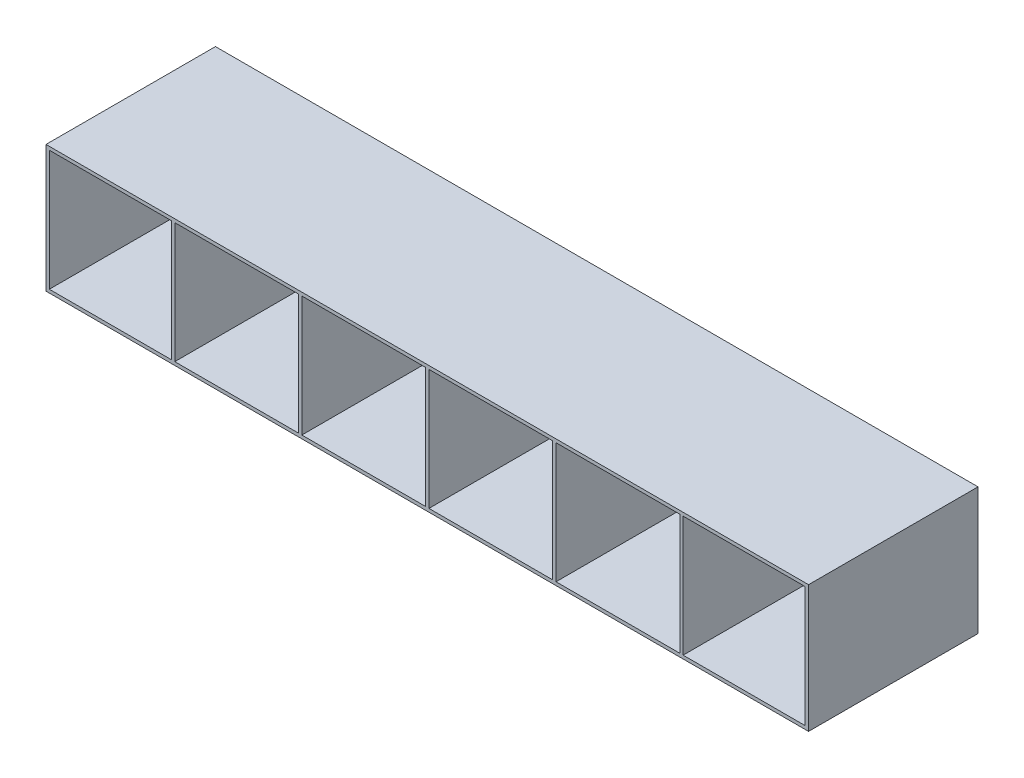
ISO-10303-21;
HEADER;
FILE_DESCRIPTION(('STEP AP214'),'2;1');
FILE_NAME('part.step','',(''),(''),'','','');
FILE_SCHEMA(('AUTOMOTIVE_DESIGN { 1 0 10303 214 1 1 1 1 }'));
ENDSEC;
DATA;
#1=APPLICATION_CONTEXT('core data for automotive mechanical design processes');
#2=APPLICATION_PROTOCOL_DEFINITION('international standard','automotive_design',2000,#1);
#3=PRODUCT_CONTEXT('',#1,'mechanical');
#4=PRODUCT('Part','Part','',(#3));
#5=PRODUCT_RELATED_PRODUCT_CATEGORY('part','',(#4));
#6=PRODUCT_DEFINITION_FORMATION('','',#4);
#7=PRODUCT_DEFINITION_CONTEXT('part definition',#1,'design');
#8=PRODUCT_DEFINITION('design','',#6,#7);
#9=PRODUCT_DEFINITION_SHAPE('','',#8);
#10=(LENGTH_UNIT() NAMED_UNIT(*) SI_UNIT(.MILLI.,.METRE.));
#11=(NAMED_UNIT(*) PLANE_ANGLE_UNIT() SI_UNIT($,.RADIAN.));
#12=(NAMED_UNIT(*) SI_UNIT($,.STERADIAN.) SOLID_ANGLE_UNIT());
#13=UNCERTAINTY_MEASURE_WITH_UNIT(LENGTH_MEASURE(1.E-05),#10,'distance_accuracy_value','');
#14=(GEOMETRIC_REPRESENTATION_CONTEXT(3) GLOBAL_UNCERTAINTY_ASSIGNED_CONTEXT((#13)) GLOBAL_UNIT_ASSIGNED_CONTEXT((#10,
#11,#12)) REPRESENTATION_CONTEXT('',''));
#15=CARTESIAN_POINT('',(0.,0.,0.));
#16=DIRECTION('',(0.,0.,1.));
#17=DIRECTION('',(1.,0.,0.));
#18=AXIS2_PLACEMENT_3D('',#15,#16,#17);
#19=CARTESIAN_POINT('',(-228.6,38.1,101.6));
#20=DIRECTION('',(1.,0.,0.));
#21=DIRECTION('',(0.,1.,0.));
#22=AXIS2_PLACEMENT_3D('',#19,#20,#21);
#23=PLANE('',#22);
#24=DIRECTION('',(0.,-1.,0.));
#25=VECTOR('',#24,1.);
#26=CARTESIAN_POINT('',(-228.6,38.1,0.));
#27=LINE('',#26,#25);
#28=CARTESIAN_POINT('',(-228.6,38.1,0.));
#29=VERTEX_POINT('',#28);
#30=CARTESIAN_POINT('',(-228.6,-38.1,0.));
#31=VERTEX_POINT('',#30);
#32=EDGE_CURVE('E411',#29,#31,#27,.T.);
#33=ORIENTED_EDGE('',*,*,#32,.T.);
#34=DIRECTION('',(0.,0.,-1.));
#35=VECTOR('',#34,1.);
#36=CARTESIAN_POINT('',(-228.6,-38.1,101.6));
#37=LINE('',#36,#35);
#38=CARTESIAN_POINT('',(-228.6,-38.1,101.6));
#39=VERTEX_POINT('',#38);
#40=EDGE_CURVE('E11',#39,#31,#37,.T.);
#41=ORIENTED_EDGE('',*,*,#40,.F.);
#42=DIRECTION('',(0.,-1.,0.));
#43=VECTOR('',#42,1.);
#44=CARTESIAN_POINT('',(-228.6,38.1,101.6));
#45=LINE('',#44,#43);
#46=CARTESIAN_POINT('',(-228.6,38.1,101.6));
#47=VERTEX_POINT('',#46);
#48=EDGE_CURVE('E412',#47,#39,#45,.T.);
#49=ORIENTED_EDGE('',*,*,#48,.F.);
#50=DIRECTION('',(0.,0.,-1.));
#51=VECTOR('',#50,1.);
#52=CARTESIAN_POINT('',(-228.6,38.1,101.6));
#53=LINE('',#52,#51);
#54=EDGE_CURVE('E424',#47,#29,#53,.T.);
#55=ORIENTED_EDGE('',*,*,#54,.T.);
#56=EDGE_LOOP('',(#33,#41,#49,#55));
#57=FACE_BOUND('',#56,.T.);
#58=ADVANCED_FACE('F35',(#57),#23,.F.);
#59=CARTESIAN_POINT('',(-228.6,-38.1,101.6));
#60=DIRECTION('',(0.,1.,0.));
#61=DIRECTION('',(0.,0.,1.));
#62=AXIS2_PLACEMENT_3D('',#59,#60,#61);
#63=PLANE('',#62);
#64=DIRECTION('',(1.,0.,0.));
#65=VECTOR('',#64,1.);
#66=CARTESIAN_POINT('',(-228.6,-38.1,0.));
#67=LINE('',#66,#65);
#68=CARTESIAN_POINT('',(228.6,-38.1,0.));
#69=VERTEX_POINT('',#68);
#70=EDGE_CURVE('E427',#31,#69,#67,.T.);
#71=ORIENTED_EDGE('',*,*,#70,.T.);
#72=DIRECTION('',(0.,0.,-1.));
#73=VECTOR('',#72,1.);
#74=CARTESIAN_POINT('',(228.6,-38.1,101.6));
#75=LINE('',#74,#73);
#76=CARTESIAN_POINT('',(228.6,-38.1,101.6));
#77=VERTEX_POINT('',#76);
#78=EDGE_CURVE('E42',#77,#69,#75,.T.);
#79=ORIENTED_EDGE('',*,*,#78,.F.);
#80=DIRECTION('',(1.,0.,0.));
#81=VECTOR('',#80,1.);
#82=CARTESIAN_POINT('',(-228.6,-38.1,101.6));
#83=LINE('',#82,#81);
#84=EDGE_CURVE('E415',#39,#77,#83,.T.);
#85=ORIENTED_EDGE('',*,*,#84,.F.);
#86=ORIENTED_EDGE('',*,*,#40,.T.);
#87=EDGE_LOOP('',(#71,#79,#85,#86));
#88=FACE_BOUND('',#87,.T.);
#89=ADVANCED_FACE('F443',(#88),#63,.F.);
#90=CARTESIAN_POINT('',(228.6,38.1,101.6));
#91=DIRECTION('',(1.,0.,0.));
#92=DIRECTION('',(0.,1.,0.));
#93=AXIS2_PLACEMENT_3D('',#90,#91,#92);
#94=PLANE('',#93);
#95=DIRECTION('',(0.,-1.,0.));
#96=VECTOR('',#95,1.);
#97=CARTESIAN_POINT('',(228.6,38.1,0.));
#98=LINE('',#97,#96);
#99=CARTESIAN_POINT('',(228.6,38.1,0.));
#100=VERTEX_POINT('',#99);
#101=EDGE_CURVE('E430',#100,#69,#98,.T.);
#102=ORIENTED_EDGE('',*,*,#101,.F.);
#103=DIRECTION('',(0.,0.,-1.));
#104=VECTOR('',#103,1.);
#105=CARTESIAN_POINT('',(228.6,38.1,101.6));
#106=LINE('',#105,#104);
#107=CARTESIAN_POINT('',(228.6,38.1,101.6));
#108=VERTEX_POINT('',#107);
#109=EDGE_CURVE('E436',#108,#100,#106,.T.);
#110=ORIENTED_EDGE('',*,*,#109,.F.);
#111=DIRECTION('',(0.,-1.,0.));
#112=VECTOR('',#111,1.);
#113=CARTESIAN_POINT('',(228.6,38.1,101.6));
#114=LINE('',#113,#112);
#115=EDGE_CURVE('E418',#108,#77,#114,.T.);
#116=ORIENTED_EDGE('',*,*,#115,.T.);
#117=ORIENTED_EDGE('',*,*,#78,.T.);
#118=EDGE_LOOP('',(#102,#110,#116,#117));
#119=FACE_BOUND('',#118,.T.);
#120=ADVANCED_FACE('F440',(#119),#94,.T.);
#121=CARTESIAN_POINT('',(-228.6,38.1,101.6));
#122=DIRECTION('',(0.,1.,0.));
#123=DIRECTION('',(0.,0.,1.));
#124=AXIS2_PLACEMENT_3D('',#121,#122,#123);
#125=PLANE('',#124);
#126=DIRECTION('',(1.,0.,0.));
#127=VECTOR('',#126,1.);
#128=CARTESIAN_POINT('',(-228.6,38.1,0.));
#129=LINE('',#128,#127);
#130=EDGE_CURVE('E416',#29,#100,#129,.T.);
#131=ORIENTED_EDGE('',*,*,#130,.F.);
#132=ORIENTED_EDGE('',*,*,#54,.F.);
#133=DIRECTION('',(1.,0.,0.));
#134=VECTOR('',#133,1.);
#135=CARTESIAN_POINT('',(-228.6,38.1,101.6));
#136=LINE('',#135,#134);
#137=EDGE_CURVE('E421',#47,#108,#136,.T.);
#138=ORIENTED_EDGE('',*,*,#137,.T.);
#139=ORIENTED_EDGE('',*,*,#109,.T.);
#140=EDGE_LOOP('',(#131,#132,#138,#139));
#141=FACE_BOUND('',#140,.T.);
#142=ADVANCED_FACE('F450',(#141),#125,.T.);
#143=CARTESIAN_POINT('',(0.,0.,101.6));
#144=DIRECTION('',(0.,0.,1.));
#145=DIRECTION('',(1.,0.,0.));
#146=AXIS2_PLACEMENT_3D('',#143,#144,#145);
#147=PLANE('',#146);
#148=DIRECTION('',(0.,-1.,0.));
#149=VECTOR('',#148,1.);
#150=CARTESIAN_POINT('',(151.4,0.,101.6));
#151=LINE('',#150,#149);
#152=CARTESIAN_POINT('',(151.4,36.1,101.6));
#153=VERTEX_POINT('',#152);
#154=CARTESIAN_POINT('',(151.4,-36.1,101.6));
#155=VERTEX_POINT('',#154);
#156=EDGE_CURVE('E232',#153,#155,#151,.T.);
#157=ORIENTED_EDGE('',*,*,#156,.T.);
#158=DIRECTION('',(1.,0.,0.));
#159=VECTOR('',#158,1.);
#160=CARTESIAN_POINT('',(0.,-36.1,101.6));
#161=LINE('',#160,#159);
#162=CARTESIAN_POINT('',(77.2,-36.1,101.6));
#163=VERTEX_POINT('',#162);
#164=EDGE_CURVE('E243',#163,#155,#161,.T.);
#165=ORIENTED_EDGE('',*,*,#164,.F.);
#166=DIRECTION('',(0.,-1.,0.));
#167=VECTOR('',#166,1.);
#168=CARTESIAN_POINT('',(77.2,0.,101.6));
#169=LINE('',#168,#167);
#170=CARTESIAN_POINT('',(77.2,36.1,101.6));
#171=VERTEX_POINT('',#170);
#172=EDGE_CURVE('E241',#171,#163,#169,.T.);
#173=ORIENTED_EDGE('',*,*,#172,.F.);
#174=DIRECTION('',(1.,0.,0.));
#175=VECTOR('',#174,1.);
#176=CARTESIAN_POINT('',(0.,36.1,101.6));
#177=LINE('',#176,#175);
#178=EDGE_CURVE('E224',#171,#153,#177,.T.);
#179=ORIENTED_EDGE('',*,*,#178,.T.);
#180=EDGE_LOOP('',(#157,#165,#173,#179));
#181=FACE_BOUND('',#180,.T.);
#182=DIRECTION('',(1.,0.,0.));
#183=VECTOR('',#182,1.);
#184=CARTESIAN_POINT('',(0.,36.1,101.6));
#185=LINE('',#184,#183);
#186=CARTESIAN_POINT('',(153.4,36.1,101.6));
#187=VERTEX_POINT('',#186);
#188=CARTESIAN_POINT('',(226.6,36.1,101.6));
#189=VERTEX_POINT('',#188);
#190=EDGE_CURVE('E257',#187,#189,#185,.T.);
#191=ORIENTED_EDGE('',*,*,#190,.T.);
#192=DIRECTION('',(0.,-1.,0.));
#193=VECTOR('',#192,1.);
#194=CARTESIAN_POINT('',(226.6,0.,101.6));
#195=LINE('',#194,#193);
#196=CARTESIAN_POINT('',(226.6,-36.1,101.6));
#197=VERTEX_POINT('',#196);
#198=EDGE_CURVE('E266',#189,#197,#195,.T.);
#199=ORIENTED_EDGE('',*,*,#198,.T.);
#200=DIRECTION('',(1.,0.,0.));
#201=VECTOR('',#200,1.);
#202=CARTESIAN_POINT('',(0.,-36.1,101.6));
#203=LINE('',#202,#201);
#204=CARTESIAN_POINT('',(153.4,-36.1,101.6));
#205=VERTEX_POINT('',#204);
#206=EDGE_CURVE('E263',#205,#197,#203,.T.);
#207=ORIENTED_EDGE('',*,*,#206,.F.);
#208=DIRECTION('',(0.,-1.,0.));
#209=VECTOR('',#208,1.);
#210=CARTESIAN_POINT('',(153.4,0.,101.6));
#211=LINE('',#210,#209);
#212=EDGE_CURVE('E260',#187,#205,#211,.T.);
#213=ORIENTED_EDGE('',*,*,#212,.F.);
#214=EDGE_LOOP('',(#191,#199,#207,#213));
#215=FACE_BOUND('',#214,.T.);
#216=DIRECTION('',(0.,-1.,0.));
#217=VECTOR('',#216,1.);
#218=CARTESIAN_POINT('',(75.2,0.,101.6));
#219=LINE('',#218,#217);
#220=CARTESIAN_POINT('',(75.2,36.1,101.6));
#221=VERTEX_POINT('',#220);
#222=CARTESIAN_POINT('',(75.2,-36.1,101.6));
#223=VERTEX_POINT('',#222);
#224=EDGE_CURVE('E288',#221,#223,#219,.T.);
#225=ORIENTED_EDGE('',*,*,#224,.T.);
#226=DIRECTION('',(1.,0.,0.));
#227=VECTOR('',#226,1.);
#228=CARTESIAN_POINT('',(0.,-36.1,101.6));
#229=LINE('',#228,#227);
#230=CARTESIAN_POINT('',(1.,-36.1,101.6));
#231=VERTEX_POINT('',#230);
#232=EDGE_CURVE('E298',#231,#223,#229,.T.);
#233=ORIENTED_EDGE('',*,*,#232,.F.);
#234=DIRECTION('',(0.,-1.,0.));
#235=VECTOR('',#234,1.);
#236=CARTESIAN_POINT('',(1.,0.,101.6));
#237=LINE('',#236,#235);
#238=CARTESIAN_POINT('',(1.,36.1,101.6));
#239=VERTEX_POINT('',#238);
#240=EDGE_CURVE('E295',#239,#231,#237,.T.);
#241=ORIENTED_EDGE('',*,*,#240,.F.);
#242=DIRECTION('',(1.,0.,0.));
#243=VECTOR('',#242,1.);
#244=CARTESIAN_POINT('',(0.,36.1,101.6));
#245=LINE('',#244,#243);
#246=EDGE_CURVE('E291',#239,#221,#245,.T.);
#247=ORIENTED_EDGE('',*,*,#246,.T.);
#248=EDGE_LOOP('',(#225,#233,#241,#247));
#249=FACE_BOUND('',#248,.T.);
#250=DIRECTION('',(0.,-1.,0.));
#251=VECTOR('',#250,1.);
#252=CARTESIAN_POINT('',(-1.,0.,101.6));
#253=LINE('',#252,#251);
#254=CARTESIAN_POINT('',(-1.,36.1,101.6));
#255=VERTEX_POINT('',#254);
#256=CARTESIAN_POINT('',(-1.,-36.1,101.6));
#257=VERTEX_POINT('',#256);
#258=EDGE_CURVE('E319',#255,#257,#253,.T.);
#259=ORIENTED_EDGE('',*,*,#258,.T.);
#260=DIRECTION('',(1.,0.,0.));
#261=VECTOR('',#260,1.);
#262=CARTESIAN_POINT('',(0.,-36.1,101.6));
#263=LINE('',#262,#261);
#264=CARTESIAN_POINT('',(-75.2,-36.1,101.6));
#265=VERTEX_POINT('',#264);
#266=EDGE_CURVE('E329',#265,#257,#263,.T.);
#267=ORIENTED_EDGE('',*,*,#266,.F.);
#268=DIRECTION('',(0.,-1.,0.));
#269=VECTOR('',#268,1.);
#270=CARTESIAN_POINT('',(-75.2,0.,101.6));
#271=LINE('',#270,#269);
#272=CARTESIAN_POINT('',(-75.2,36.1,101.6));
#273=VERTEX_POINT('',#272);
#274=EDGE_CURVE('E326',#273,#265,#271,.T.);
#275=ORIENTED_EDGE('',*,*,#274,.F.);
#276=DIRECTION('',(1.,0.,0.));
#277=VECTOR('',#276,1.);
#278=CARTESIAN_POINT('',(0.,36.1,101.6));
#279=LINE('',#278,#277);
#280=EDGE_CURVE('E322',#273,#255,#279,.T.);
#281=ORIENTED_EDGE('',*,*,#280,.T.);
#282=EDGE_LOOP('',(#259,#267,#275,#281));
#283=FACE_BOUND('',#282,.T.);
#284=DIRECTION('',(1.,0.,0.));
#285=VECTOR('',#284,1.);
#286=CARTESIAN_POINT('',(0.,36.1,101.6));
#287=LINE('',#286,#285);
#288=CARTESIAN_POINT('',(-151.4,36.1,101.6));
#289=VERTEX_POINT('',#288);
#290=CARTESIAN_POINT('',(-77.2,36.1,101.6));
#291=VERTEX_POINT('',#290);
#292=EDGE_CURVE('E350',#289,#291,#287,.T.);
#293=ORIENTED_EDGE('',*,*,#292,.T.);
#294=DIRECTION('',(0.,-1.,0.));
#295=VECTOR('',#294,1.);
#296=CARTESIAN_POINT('',(-77.2,0.,101.6));
#297=LINE('',#296,#295);
#298=CARTESIAN_POINT('',(-77.2,-36.1,101.6));
#299=VERTEX_POINT('',#298);
#300=EDGE_CURVE('E359',#291,#299,#297,.T.);
#301=ORIENTED_EDGE('',*,*,#300,.T.);
#302=DIRECTION('',(1.,0.,0.));
#303=VECTOR('',#302,1.);
#304=CARTESIAN_POINT('',(0.,-36.1,101.6));
#305=LINE('',#304,#303);
#306=CARTESIAN_POINT('',(-151.4,-36.1,101.6));
#307=VERTEX_POINT('',#306);
#308=EDGE_CURVE('E356',#307,#299,#305,.T.);
#309=ORIENTED_EDGE('',*,*,#308,.F.);
#310=DIRECTION('',(0.,-1.,0.));
#311=VECTOR('',#310,1.);
#312=CARTESIAN_POINT('',(-151.4,0.,101.6));
#313=LINE('',#312,#311);
#314=EDGE_CURVE('E353',#289,#307,#313,.T.);
#315=ORIENTED_EDGE('',*,*,#314,.F.);
#316=EDGE_LOOP('',(#293,#301,#309,#315));
#317=FACE_BOUND('',#316,.T.);
#318=DIRECTION('',(0.,-1.,0.));
#319=VECTOR('',#318,1.);
#320=CARTESIAN_POINT('',(-153.4,0.,101.6));
#321=LINE('',#320,#319);
#322=CARTESIAN_POINT('',(-153.4,36.1,101.6));
#323=VERTEX_POINT('',#322);
#324=CARTESIAN_POINT('',(-153.4,-36.1,101.6));
#325=VERTEX_POINT('',#324);
#326=EDGE_CURVE('E381',#323,#325,#321,.T.);
#327=ORIENTED_EDGE('',*,*,#326,.T.);
#328=DIRECTION('',(1.,0.,0.));
#329=VECTOR('',#328,1.);
#330=CARTESIAN_POINT('',(0.,-36.1,101.6));
#331=LINE('',#330,#329);
#332=CARTESIAN_POINT('',(-226.6,-36.1,101.6));
#333=VERTEX_POINT('',#332);
#334=EDGE_CURVE('E391',#333,#325,#331,.T.);
#335=ORIENTED_EDGE('',*,*,#334,.F.);
#336=DIRECTION('',(0.,-1.,0.));
#337=VECTOR('',#336,1.);
#338=CARTESIAN_POINT('',(-226.6,0.,101.6));
#339=LINE('',#338,#337);
#340=CARTESIAN_POINT('',(-226.6,36.1,101.6));
#341=VERTEX_POINT('',#340);
#342=EDGE_CURVE('E388',#341,#333,#339,.T.);
#343=ORIENTED_EDGE('',*,*,#342,.F.);
#344=DIRECTION('',(1.,0.,0.));
#345=VECTOR('',#344,1.);
#346=CARTESIAN_POINT('',(0.,36.1,101.6));
#347=LINE('',#346,#345);
#348=EDGE_CURVE('E384',#341,#323,#347,.T.);
#349=ORIENTED_EDGE('',*,*,#348,.T.);
#350=EDGE_LOOP('',(#327,#335,#343,#349));
#351=FACE_BOUND('',#350,.T.);
#352=ORIENTED_EDGE('',*,*,#48,.T.);
#353=ORIENTED_EDGE('',*,*,#84,.T.);
#354=ORIENTED_EDGE('',*,*,#115,.F.);
#355=ORIENTED_EDGE('',*,*,#137,.F.);
#356=EDGE_LOOP('',(#352,#353,#354,#355));
#357=FACE_BOUND('',#356,.T.);
#358=ADVANCED_FACE('F239',(#181,#215,#249,#283,#317,#351,#357),#147,.T.);
#359=CARTESIAN_POINT('',(0.,0.,0.));
#360=DIRECTION('',(0.,0.,1.));
#361=DIRECTION('',(1.,0.,0.));
#362=AXIS2_PLACEMENT_3D('',#359,#360,#361);
#363=PLANE('',#362);
#364=DIRECTION('',(1.,0.,0.));
#365=VECTOR('',#364,1.);
#366=CARTESIAN_POINT('',(0.,-36.1,0.));
#367=LINE('',#366,#365);
#368=CARTESIAN_POINT('',(77.2,-36.1,0.));
#369=VERTEX_POINT('',#368);
#370=CARTESIAN_POINT('',(151.4,-36.1,0.));
#371=VERTEX_POINT('',#370);
#372=EDGE_CURVE('E237',#369,#371,#367,.T.);
#373=ORIENTED_EDGE('',*,*,#372,.T.);
#374=DIRECTION('',(0.,-1.,0.));
#375=VECTOR('',#374,1.);
#376=CARTESIAN_POINT('',(151.4,0.,0.));
#377=LINE('',#376,#375);
#378=CARTESIAN_POINT('',(151.4,36.1,0.));
#379=VERTEX_POINT('',#378);
#380=EDGE_CURVE('E57',#379,#371,#377,.T.);
#381=ORIENTED_EDGE('',*,*,#380,.F.);
#382=DIRECTION('',(1.,0.,0.));
#383=VECTOR('',#382,1.);
#384=CARTESIAN_POINT('',(0.,36.1,0.));
#385=LINE('',#384,#383);
#386=CARTESIAN_POINT('',(77.2,36.1,0.));
#387=VERTEX_POINT('',#386);
#388=EDGE_CURVE('E227',#387,#379,#385,.T.);
#389=ORIENTED_EDGE('',*,*,#388,.F.);
#390=DIRECTION('',(0.,-1.,0.));
#391=VECTOR('',#390,1.);
#392=CARTESIAN_POINT('',(77.2,0.,0.));
#393=LINE('',#392,#391);
#394=EDGE_CURVE('E249',#387,#369,#393,.T.);
#395=ORIENTED_EDGE('',*,*,#394,.T.);
#396=EDGE_LOOP('',(#373,#381,#389,#395));
#397=FACE_BOUND('',#396,.T.);
#398=DIRECTION('',(0.,-1.,0.));
#399=VECTOR('',#398,1.);
#400=CARTESIAN_POINT('',(226.6,0.,0.));
#401=LINE('',#400,#399);
#402=CARTESIAN_POINT('',(226.6,36.1,0.));
#403=VERTEX_POINT('',#402);
#404=CARTESIAN_POINT('',(226.6,-36.1,0.));
#405=VERTEX_POINT('',#404);
#406=EDGE_CURVE('E261',#403,#405,#401,.T.);
#407=ORIENTED_EDGE('',*,*,#406,.F.);
#408=DIRECTION('',(1.,0.,0.));
#409=VECTOR('',#408,1.);
#410=CARTESIAN_POINT('',(0.,36.1,0.));
#411=LINE('',#410,#409);
#412=CARTESIAN_POINT('',(153.4,36.1,0.));
#413=VERTEX_POINT('',#412);
#414=EDGE_CURVE('E228',#413,#403,#411,.T.);
#415=ORIENTED_EDGE('',*,*,#414,.F.);
#416=DIRECTION('',(0.,-1.,0.));
#417=VECTOR('',#416,1.);
#418=CARTESIAN_POINT('',(153.4,0.,0.));
#419=LINE('',#418,#417);
#420=CARTESIAN_POINT('',(153.4,-36.1,0.));
#421=VERTEX_POINT('',#420);
#422=EDGE_CURVE('E271',#413,#421,#419,.T.);
#423=ORIENTED_EDGE('',*,*,#422,.T.);
#424=DIRECTION('',(1.,0.,0.));
#425=VECTOR('',#424,1.);
#426=CARTESIAN_POINT('',(0.,-36.1,0.));
#427=LINE('',#426,#425);
#428=EDGE_CURVE('E274',#421,#405,#427,.T.);
#429=ORIENTED_EDGE('',*,*,#428,.T.);
#430=EDGE_LOOP('',(#407,#415,#423,#429));
#431=FACE_BOUND('',#430,.T.);
#432=DIRECTION('',(1.,0.,0.));
#433=VECTOR('',#432,1.);
#434=CARTESIAN_POINT('',(0.,-36.1,0.));
#435=LINE('',#434,#433);
#436=CARTESIAN_POINT('',(1.,-36.1,0.));
#437=VERTEX_POINT('',#436);
#438=CARTESIAN_POINT('',(75.2,-36.1,0.));
#439=VERTEX_POINT('',#438);
#440=EDGE_CURVE('E292',#437,#439,#435,.T.);
#441=ORIENTED_EDGE('',*,*,#440,.T.);
#442=DIRECTION('',(0.,-1.,0.));
#443=VECTOR('',#442,1.);
#444=CARTESIAN_POINT('',(75.2,0.,0.));
#445=LINE('',#444,#443);
#446=CARTESIAN_POINT('',(75.2,36.1,0.));
#447=VERTEX_POINT('',#446);
#448=EDGE_CURVE('E287',#447,#439,#445,.T.);
#449=ORIENTED_EDGE('',*,*,#448,.F.);
#450=DIRECTION('',(1.,0.,0.));
#451=VECTOR('',#450,1.);
#452=CARTESIAN_POINT('',(0.,36.1,0.));
#453=LINE('',#452,#451);
#454=CARTESIAN_POINT('',(1.,36.1,0.));
#455=VERTEX_POINT('',#454);
#456=EDGE_CURVE('E302',#455,#447,#453,.T.);
#457=ORIENTED_EDGE('',*,*,#456,.F.);
#458=DIRECTION('',(0.,-1.,0.));
#459=VECTOR('',#458,1.);
#460=CARTESIAN_POINT('',(1.,0.,0.));
#461=LINE('',#460,#459);
#462=EDGE_CURVE('E305',#455,#437,#461,.T.);
#463=ORIENTED_EDGE('',*,*,#462,.T.);
#464=EDGE_LOOP('',(#441,#449,#457,#463));
#465=FACE_BOUND('',#464,.T.);
#466=DIRECTION('',(1.,0.,0.));
#467=VECTOR('',#466,1.);
#468=CARTESIAN_POINT('',(0.,-36.1,0.));
#469=LINE('',#468,#467);
#470=CARTESIAN_POINT('',(-75.2,-36.1,0.));
#471=VERTEX_POINT('',#470);
#472=CARTESIAN_POINT('',(-1.,-36.1,0.));
#473=VERTEX_POINT('',#472);
#474=EDGE_CURVE('E323',#471,#473,#469,.T.);
#475=ORIENTED_EDGE('',*,*,#474,.T.);
#476=DIRECTION('',(0.,-1.,0.));
#477=VECTOR('',#476,1.);
#478=CARTESIAN_POINT('',(-1.,0.,0.));
#479=LINE('',#478,#477);
#480=CARTESIAN_POINT('',(-1.,36.1,0.));
#481=VERTEX_POINT('',#480);
#482=EDGE_CURVE('E318',#481,#473,#479,.T.);
#483=ORIENTED_EDGE('',*,*,#482,.F.);
#484=DIRECTION('',(1.,0.,0.));
#485=VECTOR('',#484,1.);
#486=CARTESIAN_POINT('',(0.,36.1,0.));
#487=LINE('',#486,#485);
#488=CARTESIAN_POINT('',(-75.2,36.1,0.));
#489=VERTEX_POINT('',#488);
#490=EDGE_CURVE('E333',#489,#481,#487,.T.);
#491=ORIENTED_EDGE('',*,*,#490,.F.);
#492=DIRECTION('',(0.,-1.,0.));
#493=VECTOR('',#492,1.);
#494=CARTESIAN_POINT('',(-75.2,0.,0.));
#495=LINE('',#494,#493);
#496=EDGE_CURVE('E336',#489,#471,#495,.T.);
#497=ORIENTED_EDGE('',*,*,#496,.T.);
#498=EDGE_LOOP('',(#475,#483,#491,#497));
#499=FACE_BOUND('',#498,.T.);
#500=DIRECTION('',(0.,-1.,0.));
#501=VECTOR('',#500,1.);
#502=CARTESIAN_POINT('',(-77.2,0.,0.));
#503=LINE('',#502,#501);
#504=CARTESIAN_POINT('',(-77.2,36.1,0.));
#505=VERTEX_POINT('',#504);
#506=CARTESIAN_POINT('',(-77.2,-36.1,0.));
#507=VERTEX_POINT('',#506);
#508=EDGE_CURVE('E354',#505,#507,#503,.T.);
#509=ORIENTED_EDGE('',*,*,#508,.F.);
#510=DIRECTION('',(1.,0.,0.));
#511=VECTOR('',#510,1.);
#512=CARTESIAN_POINT('',(0.,36.1,0.));
#513=LINE('',#512,#511);
#514=CARTESIAN_POINT('',(-151.4,36.1,0.));
#515=VERTEX_POINT('',#514);
#516=EDGE_CURVE('E349',#515,#505,#513,.T.);
#517=ORIENTED_EDGE('',*,*,#516,.F.);
#518=DIRECTION('',(0.,-1.,0.));
#519=VECTOR('',#518,1.);
#520=CARTESIAN_POINT('',(-151.4,0.,0.));
#521=LINE('',#520,#519);
#522=CARTESIAN_POINT('',(-151.4,-36.1,0.));
#523=VERTEX_POINT('',#522);
#524=EDGE_CURVE('E364',#515,#523,#521,.T.);
#525=ORIENTED_EDGE('',*,*,#524,.T.);
#526=DIRECTION('',(1.,0.,0.));
#527=VECTOR('',#526,1.);
#528=CARTESIAN_POINT('',(0.,-36.1,0.));
#529=LINE('',#528,#527);
#530=EDGE_CURVE('E367',#523,#507,#529,.T.);
#531=ORIENTED_EDGE('',*,*,#530,.T.);
#532=EDGE_LOOP('',(#509,#517,#525,#531));
#533=FACE_BOUND('',#532,.T.);
#534=DIRECTION('',(1.,0.,0.));
#535=VECTOR('',#534,1.);
#536=CARTESIAN_POINT('',(0.,-36.1,0.));
#537=LINE('',#536,#535);
#538=CARTESIAN_POINT('',(-226.6,-36.1,0.));
#539=VERTEX_POINT('',#538);
#540=CARTESIAN_POINT('',(-153.4,-36.1,0.));
#541=VERTEX_POINT('',#540);
#542=EDGE_CURVE('E385',#539,#541,#537,.T.);
#543=ORIENTED_EDGE('',*,*,#542,.T.);
#544=DIRECTION('',(0.,-1.,0.));
#545=VECTOR('',#544,1.);
#546=CARTESIAN_POINT('',(-153.4,0.,0.));
#547=LINE('',#546,#545);
#548=CARTESIAN_POINT('',(-153.4,36.1,0.));
#549=VERTEX_POINT('',#548);
#550=EDGE_CURVE('E380',#549,#541,#547,.T.);
#551=ORIENTED_EDGE('',*,*,#550,.F.);
#552=DIRECTION('',(1.,0.,0.));
#553=VECTOR('',#552,1.);
#554=CARTESIAN_POINT('',(0.,36.1,0.));
#555=LINE('',#554,#553);
#556=CARTESIAN_POINT('',(-226.6,36.1,0.));
#557=VERTEX_POINT('',#556);
#558=EDGE_CURVE('E395',#557,#549,#555,.T.);
#559=ORIENTED_EDGE('',*,*,#558,.F.);
#560=DIRECTION('',(0.,-1.,0.));
#561=VECTOR('',#560,1.);
#562=CARTESIAN_POINT('',(-226.6,0.,0.));
#563=LINE('',#562,#561);
#564=EDGE_CURVE('E398',#557,#539,#563,.T.);
#565=ORIENTED_EDGE('',*,*,#564,.T.);
#566=EDGE_LOOP('',(#543,#551,#559,#565));
#567=FACE_BOUND('',#566,.T.);
#568=ORIENTED_EDGE('',*,*,#32,.F.);
#569=ORIENTED_EDGE('',*,*,#130,.T.);
#570=ORIENTED_EDGE('',*,*,#101,.T.);
#571=ORIENTED_EDGE('',*,*,#70,.F.);
#572=EDGE_LOOP('',(#568,#569,#570,#571));
#573=FACE_BOUND('',#572,.T.);
#574=ADVANCED_FACE('F447',(#397,#431,#465,#499,#533,#567,#573),#363,.F.);
#575=CARTESIAN_POINT('',(-153.4,0.,101.6));
#576=DIRECTION('',(1.,0.,0.));
#577=DIRECTION('',(0.,0.,-1.));
#578=AXIS2_PLACEMENT_3D('',#575,#576,#577);
#579=PLANE('',#578);
#580=ORIENTED_EDGE('',*,*,#550,.T.);
#581=DIRECTION('',(0.,0.,-1.));
#582=VECTOR('',#581,1.);
#583=CARTESIAN_POINT('',(-153.4,-36.1,101.6));
#584=LINE('',#583,#582);
#585=EDGE_CURVE('E393',#325,#541,#584,.T.);
#586=ORIENTED_EDGE('',*,*,#585,.F.);
#587=ORIENTED_EDGE('',*,*,#326,.F.);
#588=DIRECTION('',(0.,0.,-1.));
#589=VECTOR('',#588,1.);
#590=CARTESIAN_POINT('',(-153.4,36.1,101.6));
#591=LINE('',#590,#589);
#592=EDGE_CURVE('E409',#323,#549,#591,.T.);
#593=ORIENTED_EDGE('',*,*,#592,.T.);
#594=EDGE_LOOP('',(#580,#586,#587,#593));
#595=FACE_BOUND('',#594,.T.);
#596=ADVANCED_FACE('F468',(#595),#579,.F.);
#597=CARTESIAN_POINT('',(0.,36.1,101.6));
#598=DIRECTION('',(0.,1.,0.));
#599=DIRECTION('',(0.,0.,1.));
#600=AXIS2_PLACEMENT_3D('',#597,#598,#599);
#601=PLANE('',#600);
#602=ORIENTED_EDGE('',*,*,#558,.T.);
#603=ORIENTED_EDGE('',*,*,#592,.F.);
#604=ORIENTED_EDGE('',*,*,#348,.F.);
#605=DIRECTION('',(0.,0.,-1.));
#606=VECTOR('',#605,1.);
#607=CARTESIAN_POINT('',(-226.6,36.1,101.6));
#608=LINE('',#607,#606);
#609=EDGE_CURVE('E407',#341,#557,#608,.T.);
#610=ORIENTED_EDGE('',*,*,#609,.T.);
#611=EDGE_LOOP('',(#602,#603,#604,#610));
#612=FACE_BOUND('',#611,.T.);
#613=ADVANCED_FACE('F474',(#612),#601,.F.);
#614=CARTESIAN_POINT('',(-226.6,0.,101.6));
#615=DIRECTION('',(1.,0.,0.));
#616=DIRECTION('',(0.,0.,-1.));
#617=AXIS2_PLACEMENT_3D('',#614,#615,#616);
#618=PLANE('',#617);
#619=ORIENTED_EDGE('',*,*,#564,.F.);
#620=ORIENTED_EDGE('',*,*,#609,.F.);
#621=ORIENTED_EDGE('',*,*,#342,.T.);
#622=DIRECTION('',(0.,0.,-1.));
#623=VECTOR('',#622,1.);
#624=CARTESIAN_POINT('',(-226.6,-36.1,101.6));
#625=LINE('',#624,#623);
#626=EDGE_CURVE('E405',#333,#539,#625,.T.);
#627=ORIENTED_EDGE('',*,*,#626,.T.);
#628=EDGE_LOOP('',(#619,#620,#621,#627));
#629=FACE_BOUND('',#628,.T.);
#630=ADVANCED_FACE('F478',(#629),#618,.T.);
#631=CARTESIAN_POINT('',(0.,-36.1,101.6));
#632=DIRECTION('',(0.,1.,0.));
#633=DIRECTION('',(0.,0.,1.));
#634=AXIS2_PLACEMENT_3D('',#631,#632,#633);
#635=PLANE('',#634);
#636=ORIENTED_EDGE('',*,*,#542,.F.);
#637=ORIENTED_EDGE('',*,*,#626,.F.);
#638=ORIENTED_EDGE('',*,*,#334,.T.);
#639=ORIENTED_EDGE('',*,*,#585,.T.);
#640=EDGE_LOOP('',(#636,#637,#638,#639));
#641=FACE_BOUND('',#640,.T.);
#642=ADVANCED_FACE('F482',(#641),#635,.T.);
#643=CARTESIAN_POINT('',(0.,36.1,101.6));
#644=DIRECTION('',(0.,1.,0.));
#645=DIRECTION('',(0.,0.,1.));
#646=AXIS2_PLACEMENT_3D('',#643,#644,#645);
#647=PLANE('',#646);
#648=ORIENTED_EDGE('',*,*,#516,.T.);
#649=DIRECTION('',(0.,0.,-1.));
#650=VECTOR('',#649,1.);
#651=CARTESIAN_POINT('',(-77.2,36.1,101.6));
#652=LINE('',#651,#650);
#653=EDGE_CURVE('E362',#291,#505,#652,.T.);
#654=ORIENTED_EDGE('',*,*,#653,.F.);
#655=ORIENTED_EDGE('',*,*,#292,.F.);
#656=DIRECTION('',(0.,0.,-1.));
#657=VECTOR('',#656,1.);
#658=CARTESIAN_POINT('',(-151.4,36.1,101.6));
#659=LINE('',#658,#657);
#660=EDGE_CURVE('E378',#289,#515,#659,.T.);
#661=ORIENTED_EDGE('',*,*,#660,.T.);
#662=EDGE_LOOP('',(#648,#654,#655,#661));
#663=FACE_BOUND('',#662,.T.);
#664=ADVANCED_FACE('F486',(#663),#647,.F.);
#665=CARTESIAN_POINT('',(-151.4,0.,101.6));
#666=DIRECTION('',(1.,0.,0.));
#667=DIRECTION('',(0.,0.,-1.));
#668=AXIS2_PLACEMENT_3D('',#665,#666,#667);
#669=PLANE('',#668);
#670=ORIENTED_EDGE('',*,*,#524,.F.);
#671=ORIENTED_EDGE('',*,*,#660,.F.);
#672=ORIENTED_EDGE('',*,*,#314,.T.);
#673=DIRECTION('',(0.,0.,-1.));
#674=VECTOR('',#673,1.);
#675=CARTESIAN_POINT('',(-151.4,-36.1,101.6));
#676=LINE('',#675,#674);
#677=EDGE_CURVE('E376',#307,#523,#676,.T.);
#678=ORIENTED_EDGE('',*,*,#677,.T.);
#679=EDGE_LOOP('',(#670,#671,#672,#678));
#680=FACE_BOUND('',#679,.T.);
#681=ADVANCED_FACE('F490',(#680),#669,.T.);
#682=CARTESIAN_POINT('',(0.,-36.1,101.6));
#683=DIRECTION('',(0.,1.,0.));
#684=DIRECTION('',(0.,0.,1.));
#685=AXIS2_PLACEMENT_3D('',#682,#683,#684);
#686=PLANE('',#685);
#687=ORIENTED_EDGE('',*,*,#530,.F.);
#688=ORIENTED_EDGE('',*,*,#677,.F.);
#689=ORIENTED_EDGE('',*,*,#308,.T.);
#690=DIRECTION('',(0.,0.,-1.));
#691=VECTOR('',#690,1.);
#692=CARTESIAN_POINT('',(-77.2,-36.1,101.6));
#693=LINE('',#692,#691);
#694=EDGE_CURVE('E374',#299,#507,#693,.T.);
#695=ORIENTED_EDGE('',*,*,#694,.T.);
#696=EDGE_LOOP('',(#687,#688,#689,#695));
#697=FACE_BOUND('',#696,.T.);
#698=ADVANCED_FACE('F494',(#697),#686,.T.);
#699=CARTESIAN_POINT('',(-77.2,0.,101.6));
#700=DIRECTION('',(1.,0.,0.));
#701=DIRECTION('',(0.,0.,-1.));
#702=AXIS2_PLACEMENT_3D('',#699,#700,#701);
#703=PLANE('',#702);
#704=ORIENTED_EDGE('',*,*,#508,.T.);
#705=ORIENTED_EDGE('',*,*,#694,.F.);
#706=ORIENTED_EDGE('',*,*,#300,.F.);
#707=ORIENTED_EDGE('',*,*,#653,.T.);
#708=EDGE_LOOP('',(#704,#705,#706,#707));
#709=FACE_BOUND('',#708,.T.);
#710=ADVANCED_FACE('F498',(#709),#703,.F.);
#711=CARTESIAN_POINT('',(-1.,0.,101.6));
#712=DIRECTION('',(1.,0.,0.));
#713=DIRECTION('',(0.,0.,-1.));
#714=AXIS2_PLACEMENT_3D('',#711,#712,#713);
#715=PLANE('',#714);
#716=ORIENTED_EDGE('',*,*,#482,.T.);
#717=DIRECTION('',(0.,0.,-1.));
#718=VECTOR('',#717,1.);
#719=CARTESIAN_POINT('',(-1.,-36.1,101.6));
#720=LINE('',#719,#718);
#721=EDGE_CURVE('E331',#257,#473,#720,.T.);
#722=ORIENTED_EDGE('',*,*,#721,.F.);
#723=ORIENTED_EDGE('',*,*,#258,.F.);
#724=DIRECTION('',(0.,0.,-1.));
#725=VECTOR('',#724,1.);
#726=CARTESIAN_POINT('',(-1.,36.1,101.6));
#727=LINE('',#726,#725);
#728=EDGE_CURVE('E347',#255,#481,#727,.T.);
#729=ORIENTED_EDGE('',*,*,#728,.T.);
#730=EDGE_LOOP('',(#716,#722,#723,#729));
#731=FACE_BOUND('',#730,.T.);
#732=ADVANCED_FACE('F502',(#731),#715,.F.);
#733=CARTESIAN_POINT('',(0.,36.1,101.6));
#734=DIRECTION('',(0.,1.,0.));
#735=DIRECTION('',(0.,0.,1.));
#736=AXIS2_PLACEMENT_3D('',#733,#734,#735);
#737=PLANE('',#736);
#738=ORIENTED_EDGE('',*,*,#490,.T.);
#739=ORIENTED_EDGE('',*,*,#728,.F.);
#740=ORIENTED_EDGE('',*,*,#280,.F.);
#741=DIRECTION('',(0.,0.,-1.));
#742=VECTOR('',#741,1.);
#743=CARTESIAN_POINT('',(-75.2,36.1,101.6));
#744=LINE('',#743,#742);
#745=EDGE_CURVE('E345',#273,#489,#744,.T.);
#746=ORIENTED_EDGE('',*,*,#745,.T.);
#747=EDGE_LOOP('',(#738,#739,#740,#746));
#748=FACE_BOUND('',#747,.T.);
#749=ADVANCED_FACE('F506',(#748),#737,.F.);
#750=CARTESIAN_POINT('',(-75.2,0.,101.6));
#751=DIRECTION('',(1.,0.,0.));
#752=DIRECTION('',(0.,0.,-1.));
#753=AXIS2_PLACEMENT_3D('',#750,#751,#752);
#754=PLANE('',#753);
#755=ORIENTED_EDGE('',*,*,#496,.F.);
#756=ORIENTED_EDGE('',*,*,#745,.F.);
#757=ORIENTED_EDGE('',*,*,#274,.T.);
#758=DIRECTION('',(0.,0.,-1.));
#759=VECTOR('',#758,1.);
#760=CARTESIAN_POINT('',(-75.2,-36.1,101.6));
#761=LINE('',#760,#759);
#762=EDGE_CURVE('E343',#265,#471,#761,.T.);
#763=ORIENTED_EDGE('',*,*,#762,.T.);
#764=EDGE_LOOP('',(#755,#756,#757,#763));
#765=FACE_BOUND('',#764,.T.);
#766=ADVANCED_FACE('F510',(#765),#754,.T.);
#767=CARTESIAN_POINT('',(0.,-36.1,101.6));
#768=DIRECTION('',(0.,1.,0.));
#769=DIRECTION('',(0.,0.,1.));
#770=AXIS2_PLACEMENT_3D('',#767,#768,#769);
#771=PLANE('',#770);
#772=ORIENTED_EDGE('',*,*,#474,.F.);
#773=ORIENTED_EDGE('',*,*,#762,.F.);
#774=ORIENTED_EDGE('',*,*,#266,.T.);
#775=ORIENTED_EDGE('',*,*,#721,.T.);
#776=EDGE_LOOP('',(#772,#773,#774,#775));
#777=FACE_BOUND('',#776,.T.);
#778=ADVANCED_FACE('F514',(#777),#771,.T.);
#779=CARTESIAN_POINT('',(75.2,0.,101.6));
#780=DIRECTION('',(1.,0.,0.));
#781=DIRECTION('',(0.,0.,-1.));
#782=AXIS2_PLACEMENT_3D('',#779,#780,#781);
#783=PLANE('',#782);
#784=ORIENTED_EDGE('',*,*,#448,.T.);
#785=DIRECTION('',(0.,0.,-1.));
#786=VECTOR('',#785,1.);
#787=CARTESIAN_POINT('',(75.2,-36.1,101.6));
#788=LINE('',#787,#786);
#789=EDGE_CURVE('E300',#223,#439,#788,.T.);
#790=ORIENTED_EDGE('',*,*,#789,.F.);
#791=ORIENTED_EDGE('',*,*,#224,.F.);
#792=DIRECTION('',(0.,0.,-1.));
#793=VECTOR('',#792,1.);
#794=CARTESIAN_POINT('',(75.2,36.1,101.6));
#795=LINE('',#794,#793);
#796=EDGE_CURVE('E316',#221,#447,#795,.T.);
#797=ORIENTED_EDGE('',*,*,#796,.T.);
#798=EDGE_LOOP('',(#784,#790,#791,#797));
#799=FACE_BOUND('',#798,.T.);
#800=ADVANCED_FACE('F518',(#799),#783,.F.);
#801=CARTESIAN_POINT('',(0.,36.1,101.6));
#802=DIRECTION('',(0.,1.,0.));
#803=DIRECTION('',(0.,0.,1.));
#804=AXIS2_PLACEMENT_3D('',#801,#802,#803);
#805=PLANE('',#804);
#806=ORIENTED_EDGE('',*,*,#456,.T.);
#807=ORIENTED_EDGE('',*,*,#796,.F.);
#808=ORIENTED_EDGE('',*,*,#246,.F.);
#809=DIRECTION('',(0.,0.,-1.));
#810=VECTOR('',#809,1.);
#811=CARTESIAN_POINT('',(1.,36.1,101.6));
#812=LINE('',#811,#810);
#813=EDGE_CURVE('E314',#239,#455,#812,.T.);
#814=ORIENTED_EDGE('',*,*,#813,.T.);
#815=EDGE_LOOP('',(#806,#807,#808,#814));
#816=FACE_BOUND('',#815,.T.);
#817=ADVANCED_FACE('F522',(#816),#805,.F.);
#818=CARTESIAN_POINT('',(1.,0.,101.6));
#819=DIRECTION('',(1.,0.,0.));
#820=DIRECTION('',(0.,0.,-1.));
#821=AXIS2_PLACEMENT_3D('',#818,#819,#820);
#822=PLANE('',#821);
#823=ORIENTED_EDGE('',*,*,#462,.F.);
#824=ORIENTED_EDGE('',*,*,#813,.F.);
#825=ORIENTED_EDGE('',*,*,#240,.T.);
#826=DIRECTION('',(0.,0.,-1.));
#827=VECTOR('',#826,1.);
#828=CARTESIAN_POINT('',(1.,-36.1,101.6));
#829=LINE('',#828,#827);
#830=EDGE_CURVE('E312',#231,#437,#829,.T.);
#831=ORIENTED_EDGE('',*,*,#830,.T.);
#832=EDGE_LOOP('',(#823,#824,#825,#831));
#833=FACE_BOUND('',#832,.T.);
#834=ADVANCED_FACE('F526',(#833),#822,.T.);
#835=CARTESIAN_POINT('',(0.,-36.1,101.6));
#836=DIRECTION('',(0.,1.,0.));
#837=DIRECTION('',(0.,0.,1.));
#838=AXIS2_PLACEMENT_3D('',#835,#836,#837);
#839=PLANE('',#838);
#840=ORIENTED_EDGE('',*,*,#440,.F.);
#841=ORIENTED_EDGE('',*,*,#830,.F.);
#842=ORIENTED_EDGE('',*,*,#232,.T.);
#843=ORIENTED_EDGE('',*,*,#789,.T.);
#844=EDGE_LOOP('',(#840,#841,#842,#843));
#845=FACE_BOUND('',#844,.T.);
#846=ADVANCED_FACE('F530',(#845),#839,.T.);
#847=CARTESIAN_POINT('',(0.,36.1,101.6));
#848=DIRECTION('',(0.,1.,0.));
#849=DIRECTION('',(0.,0.,1.));
#850=AXIS2_PLACEMENT_3D('',#847,#848,#849);
#851=PLANE('',#850);
#852=ORIENTED_EDGE('',*,*,#414,.T.);
#853=DIRECTION('',(0.,0.,-1.));
#854=VECTOR('',#853,1.);
#855=CARTESIAN_POINT('',(226.6,36.1,101.6));
#856=LINE('',#855,#854);
#857=EDGE_CURVE('E269',#189,#403,#856,.T.);
#858=ORIENTED_EDGE('',*,*,#857,.F.);
#859=ORIENTED_EDGE('',*,*,#190,.F.);
#860=DIRECTION('',(0.,0.,-1.));
#861=VECTOR('',#860,1.);
#862=CARTESIAN_POINT('',(153.4,36.1,101.6));
#863=LINE('',#862,#861);
#864=EDGE_CURVE('E285',#187,#413,#863,.T.);
#865=ORIENTED_EDGE('',*,*,#864,.T.);
#866=EDGE_LOOP('',(#852,#858,#859,#865));
#867=FACE_BOUND('',#866,.T.);
#868=ADVANCED_FACE('F534',(#867),#851,.F.);
#869=CARTESIAN_POINT('',(153.4,0.,101.6));
#870=DIRECTION('',(1.,0.,0.));
#871=DIRECTION('',(0.,0.,-1.));
#872=AXIS2_PLACEMENT_3D('',#869,#870,#871);
#873=PLANE('',#872);
#874=ORIENTED_EDGE('',*,*,#422,.F.);
#875=ORIENTED_EDGE('',*,*,#864,.F.);
#876=ORIENTED_EDGE('',*,*,#212,.T.);
#877=DIRECTION('',(0.,0.,-1.));
#878=VECTOR('',#877,1.);
#879=CARTESIAN_POINT('',(153.4,-36.1,101.6));
#880=LINE('',#879,#878);
#881=EDGE_CURVE('E283',#205,#421,#880,.T.);
#882=ORIENTED_EDGE('',*,*,#881,.T.);
#883=EDGE_LOOP('',(#874,#875,#876,#882));
#884=FACE_BOUND('',#883,.T.);
#885=ADVANCED_FACE('F538',(#884),#873,.T.);
#886=CARTESIAN_POINT('',(0.,-36.1,101.6));
#887=DIRECTION('',(0.,1.,0.));
#888=DIRECTION('',(0.,0.,1.));
#889=AXIS2_PLACEMENT_3D('',#886,#887,#888);
#890=PLANE('',#889);
#891=ORIENTED_EDGE('',*,*,#428,.F.);
#892=ORIENTED_EDGE('',*,*,#881,.F.);
#893=ORIENTED_EDGE('',*,*,#206,.T.);
#894=DIRECTION('',(0.,0.,-1.));
#895=VECTOR('',#894,1.);
#896=CARTESIAN_POINT('',(226.6,-36.1,101.6));
#897=LINE('',#896,#895);
#898=EDGE_CURVE('E281',#197,#405,#897,.T.);
#899=ORIENTED_EDGE('',*,*,#898,.T.);
#900=EDGE_LOOP('',(#891,#892,#893,#899));
#901=FACE_BOUND('',#900,.T.);
#902=ADVANCED_FACE('F542',(#901),#890,.T.);
#903=CARTESIAN_POINT('',(226.6,0.,101.6));
#904=DIRECTION('',(1.,0.,0.));
#905=DIRECTION('',(0.,0.,-1.));
#906=AXIS2_PLACEMENT_3D('',#903,#904,#905);
#907=PLANE('',#906);
#908=ORIENTED_EDGE('',*,*,#406,.T.);
#909=ORIENTED_EDGE('',*,*,#898,.F.);
#910=ORIENTED_EDGE('',*,*,#198,.F.);
#911=ORIENTED_EDGE('',*,*,#857,.T.);
#912=EDGE_LOOP('',(#908,#909,#910,#911));
#913=FACE_BOUND('',#912,.T.);
#914=ADVANCED_FACE('F546',(#913),#907,.F.);
#915=CARTESIAN_POINT('',(151.4,0.,101.6));
#916=DIRECTION('',(1.,0.,0.));
#917=DIRECTION('',(0.,0.,-1.));
#918=AXIS2_PLACEMENT_3D('',#915,#916,#917);
#919=PLANE('',#918);
#920=ORIENTED_EDGE('',*,*,#380,.T.);
#921=DIRECTION('',(0.,0.,-1.));
#922=VECTOR('',#921,1.);
#923=CARTESIAN_POINT('',(151.4,-36.1,101.6));
#924=LINE('',#923,#922);
#925=EDGE_CURVE('E234',#155,#371,#924,.T.);
#926=ORIENTED_EDGE('',*,*,#925,.F.);
#927=ORIENTED_EDGE('',*,*,#156,.F.);
#928=DIRECTION('',(0.,0.,-1.));
#929=VECTOR('',#928,1.);
#930=CARTESIAN_POINT('',(151.4,36.1,101.6));
#931=LINE('',#930,#929);
#932=EDGE_CURVE('E220',#153,#379,#931,.T.);
#933=ORIENTED_EDGE('',*,*,#932,.T.);
#934=EDGE_LOOP('',(#920,#926,#927,#933));
#935=FACE_BOUND('',#934,.T.);
#936=ADVANCED_FACE('F233',(#935),#919,.F.);
#937=CARTESIAN_POINT('',(0.,36.1,101.6));
#938=DIRECTION('',(0.,1.,0.));
#939=DIRECTION('',(0.,0.,1.));
#940=AXIS2_PLACEMENT_3D('',#937,#938,#939);
#941=PLANE('',#940);
#942=ORIENTED_EDGE('',*,*,#388,.T.);
#943=ORIENTED_EDGE('',*,*,#932,.F.);
#944=ORIENTED_EDGE('',*,*,#178,.F.);
#945=DIRECTION('',(0.,0.,-1.));
#946=VECTOR('',#945,1.);
#947=CARTESIAN_POINT('',(77.2,36.1,101.6));
#948=LINE('',#947,#946);
#949=EDGE_CURVE('E229',#171,#387,#948,.T.);
#950=ORIENTED_EDGE('',*,*,#949,.T.);
#951=EDGE_LOOP('',(#942,#943,#944,#950));
#952=FACE_BOUND('',#951,.T.);
#953=ADVANCED_FACE('F222',(#952),#941,.F.);
#954=CARTESIAN_POINT('',(77.2,0.,101.6));
#955=DIRECTION('',(1.,0.,0.));
#956=DIRECTION('',(0.,0.,-1.));
#957=AXIS2_PLACEMENT_3D('',#954,#955,#956);
#958=PLANE('',#957);
#959=ORIENTED_EDGE('',*,*,#394,.F.);
#960=ORIENTED_EDGE('',*,*,#949,.F.);
#961=ORIENTED_EDGE('',*,*,#172,.T.);
#962=DIRECTION('',(0.,0.,-1.));
#963=VECTOR('',#962,1.);
#964=CARTESIAN_POINT('',(77.2,-36.1,101.6));
#965=LINE('',#964,#963);
#966=EDGE_CURVE('E49',#163,#369,#965,.T.);
#967=ORIENTED_EDGE('',*,*,#966,.T.);
#968=EDGE_LOOP('',(#959,#960,#961,#967));
#969=FACE_BOUND('',#968,.T.);
#970=ADVANCED_FACE('F555',(#969),#958,.T.);
#971=CARTESIAN_POINT('',(0.,-36.1,101.6));
#972=DIRECTION('',(0.,1.,0.));
#973=DIRECTION('',(0.,0.,1.));
#974=AXIS2_PLACEMENT_3D('',#971,#972,#973);
#975=PLANE('',#974);
#976=ORIENTED_EDGE('',*,*,#372,.F.);
#977=ORIENTED_EDGE('',*,*,#966,.F.);
#978=ORIENTED_EDGE('',*,*,#164,.T.);
#979=ORIENTED_EDGE('',*,*,#925,.T.);
#980=EDGE_LOOP('',(#976,#977,#978,#979));
#981=FACE_BOUND('',#980,.T.);
#982=ADVANCED_FACE('F558',(#981),#975,.T.);
#983=CLOSED_SHELL('',(#58,#89,#120,#142,#358,#574,#596,#613,#630,#642,#664,#681,#698,#710,#732,
#749,#766,#778,#800,#817,#834,#846,#868,#885,#902,#914,#936,#953,#970,#982));
#984=MANIFOLD_SOLID_BREP('B2',#983);
#985=ADVANCED_BREP_SHAPE_REPRESENTATION('',(#18,#984),#14);
#986=SHAPE_DEFINITION_REPRESENTATION(#9,#985);
ENDSEC;
END-ISO-10303-21;
